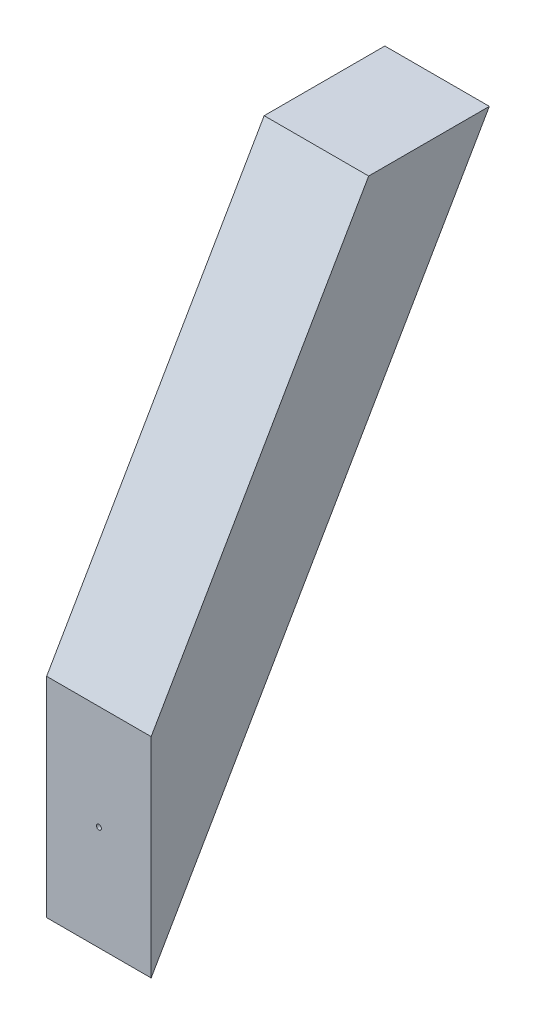
ISO-10303-21;
HEADER;
FILE_DESCRIPTION(('STEP AP214'),'2;1');
FILE_NAME('part.step','',(''),(''),'','','');
FILE_SCHEMA(('AUTOMOTIVE_DESIGN { 1 0 10303 214 1 1 1 1 }'));
ENDSEC;
DATA;
#1=APPLICATION_CONTEXT('core data for automotive mechanical design processes');
#2=APPLICATION_PROTOCOL_DEFINITION('international standard','automotive_design',2000,#1);
#3=PRODUCT_CONTEXT('',#1,'mechanical');
#4=PRODUCT('Part','Part','',(#3));
#5=PRODUCT_RELATED_PRODUCT_CATEGORY('part','',(#4));
#6=PRODUCT_DEFINITION_FORMATION('','',#4);
#7=PRODUCT_DEFINITION_CONTEXT('part definition',#1,'design');
#8=PRODUCT_DEFINITION('design','',#6,#7);
#9=PRODUCT_DEFINITION_SHAPE('','',#8);
#10=(LENGTH_UNIT() NAMED_UNIT(*) SI_UNIT(.MILLI.,.METRE.));
#11=(NAMED_UNIT(*) PLANE_ANGLE_UNIT() SI_UNIT($,.RADIAN.));
#12=(NAMED_UNIT(*) SI_UNIT($,.STERADIAN.) SOLID_ANGLE_UNIT());
#13=UNCERTAINTY_MEASURE_WITH_UNIT(LENGTH_MEASURE(1.E-05),#10,'distance_accuracy_value','');
#14=(GEOMETRIC_REPRESENTATION_CONTEXT(3) GLOBAL_UNCERTAINTY_ASSIGNED_CONTEXT((#13)) GLOBAL_UNIT_ASSIGNED_CONTEXT((#10,
#11,#12)) REPRESENTATION_CONTEXT('',''));
#15=CARTESIAN_POINT('',(0.,0.,0.));
#16=DIRECTION('',(0.,0.,1.));
#17=DIRECTION('',(1.,0.,0.));
#18=AXIS2_PLACEMENT_3D('',#15,#16,#17);
#19=CARTESIAN_POINT('',(12.7,142.357937738898,-82.1903936748331));
#20=DIRECTION('',(0.,0.500000000000001,0.866025403784438));
#21=DIRECTION('',(0.,-0.866025403784438,0.500000000000001));
#22=AXIS2_PLACEMENT_3D('',#19,#20,#21);
#23=PLANE('',#22);
#24=DIRECTION('',(0.,0.866025403784438,-0.500000000000001));
#25=VECTOR('',#24,1.);
#26=CARTESIAN_POINT('',(-12.7,142.357937738898,-82.1903936748331));
#27=LINE('',#26,#25);
#28=CARTESIAN_POINT('',(-12.7,0.,0.));
#29=VERTEX_POINT('',#28);
#30=CARTESIAN_POINT('',(-12.7,142.357937738898,-82.1903936748331));
#31=VERTEX_POINT('',#30);
#32=EDGE_CURVE('E95',#29,#31,#27,.T.);
#33=ORIENTED_EDGE('',*,*,#32,.T.);
#34=DIRECTION('',(-1.,0.,0.));
#35=VECTOR('',#34,1.);
#36=CARTESIAN_POINT('',(12.7,142.357937738898,-82.1903936748331));
#37=LINE('',#36,#35);
#38=CARTESIAN_POINT('',(12.7,142.357937738898,-82.1903936748331));
#39=VERTEX_POINT('',#38);
#40=EDGE_CURVE('E11',#39,#31,#37,.T.);
#41=ORIENTED_EDGE('',*,*,#40,.F.);
#42=DIRECTION('',(0.,0.866025403784438,-0.500000000000001));
#43=VECTOR('',#42,1.);
#44=CARTESIAN_POINT('',(12.7,142.357937738898,-82.1903936748331));
#45=LINE('',#44,#43);
#46=CARTESIAN_POINT('',(12.7,0.,0.));
#47=VERTEX_POINT('',#46);
#48=EDGE_CURVE('E104',#47,#39,#45,.T.);
#49=ORIENTED_EDGE('',*,*,#48,.F.);
#50=DIRECTION('',(-1.,0.,0.));
#51=VECTOR('',#50,1.);
#52=CARTESIAN_POINT('',(12.7,0.,0.));
#53=LINE('',#52,#51);
#54=EDGE_CURVE('E109',#47,#29,#53,.T.);
#55=ORIENTED_EDGE('',*,*,#54,.T.);
#56=EDGE_LOOP('',(#33,#41,#49,#55));
#57=FACE_BOUND('',#56,.T.);
#58=ADVANCED_FACE('F34',(#57),#23,.F.);
#59=CARTESIAN_POINT('',(12.7,142.357937738898,-52.8610000000001));
#60=DIRECTION('',(0.,-1.,0.));
#61=DIRECTION('',(0.,0.,-1.));
#62=AXIS2_PLACEMENT_3D('',#59,#60,#61);
#63=PLANE('',#62);
#64=DIRECTION('',(0.,0.,1.));
#65=VECTOR('',#64,1.);
#66=CARTESIAN_POINT('',(-12.7,142.357937738898,-52.8610000000001));
#67=LINE('',#66,#65);
#68=CARTESIAN_POINT('',(-12.7,142.357937738898,-52.8610000000001));
#69=VERTEX_POINT('',#68);
#70=EDGE_CURVE('E99',#31,#69,#67,.T.);
#71=ORIENTED_EDGE('',*,*,#70,.T.);
#72=DIRECTION('',(-1.,0.,0.));
#73=VECTOR('',#72,1.);
#74=CARTESIAN_POINT('',(12.7,142.357937738898,-52.8610000000001));
#75=LINE('',#74,#73);
#76=CARTESIAN_POINT('',(12.7,142.357937738898,-52.8610000000001));
#77=VERTEX_POINT('',#76);
#78=EDGE_CURVE('E42',#77,#69,#75,.T.);
#79=ORIENTED_EDGE('',*,*,#78,.F.);
#80=DIRECTION('',(0.,0.,1.));
#81=VECTOR('',#80,1.);
#82=CARTESIAN_POINT('',(12.7,142.357937738898,-52.8610000000001));
#83=LINE('',#82,#81);
#84=EDGE_CURVE('E81',#39,#77,#83,.T.);
#85=ORIENTED_EDGE('',*,*,#84,.F.);
#86=ORIENTED_EDGE('',*,*,#40,.T.);
#87=EDGE_LOOP('',(#71,#79,#85,#86));
#88=FACE_BOUND('',#87,.T.);
#89=ADVANCED_FACE('F133',(#88),#63,.F.);
#90=CARTESIAN_POINT('',(12.7,50.7999999999999,0.));
#91=DIRECTION('',(0.,-0.500000000000001,-0.866025403784438));
#92=DIRECTION('',(0.,0.866025403784438,-0.500000000000001));
#93=AXIS2_PLACEMENT_3D('',#90,#91,#92);
#94=PLANE('',#93);
#95=DIRECTION('',(0.,-0.866025403784438,0.500000000000001));
#96=VECTOR('',#95,1.);
#97=CARTESIAN_POINT('',(-12.7,50.7999999999999,0.));
#98=LINE('',#97,#96);
#99=CARTESIAN_POINT('',(-12.7,50.7999999999999,0.));
#100=VERTEX_POINT('',#99);
#101=EDGE_CURVE('E68',#69,#100,#98,.T.);
#102=ORIENTED_EDGE('',*,*,#101,.T.);
#103=DIRECTION('',(-1.,0.,0.));
#104=VECTOR('',#103,1.);
#105=CARTESIAN_POINT('',(12.7,50.7999999999999,0.));
#106=LINE('',#105,#104);
#107=CARTESIAN_POINT('',(12.7,50.7999999999999,0.));
#108=VERTEX_POINT('',#107);
#109=EDGE_CURVE('E115',#108,#100,#106,.T.);
#110=ORIENTED_EDGE('',*,*,#109,.F.);
#111=DIRECTION('',(0.,-0.866025403784438,0.500000000000001));
#112=VECTOR('',#111,1.);
#113=CARTESIAN_POINT('',(12.7,50.7999999999999,0.));
#114=LINE('',#113,#112);
#115=EDGE_CURVE('E107',#77,#108,#114,.T.);
#116=ORIENTED_EDGE('',*,*,#115,.F.);
#117=ORIENTED_EDGE('',*,*,#78,.T.);
#118=EDGE_LOOP('',(#102,#110,#116,#117));
#119=FACE_BOUND('',#118,.T.);
#120=ADVANCED_FACE('F117',(#119),#94,.F.);
#121=CARTESIAN_POINT('',(12.7,0.,0.));
#122=DIRECTION('',(0.,0.,-1.));
#123=DIRECTION('',(-1.,0.,0.));
#124=AXIS2_PLACEMENT_3D('',#121,#122,#123);
#125=PLANE('',#124);
#126=CARTESIAN_POINT('',(0.,25.3999999999999,0.));
#127=DIRECTION('',(0.,0.,1.));
#128=DIRECTION('',(1.,0.,0.));
#129=AXIS2_PLACEMENT_3D('',#126,#127,#128);
#130=CIRCLE('',#129,0.595629999999997);
#131=CARTESIAN_POINT('',(0.595629999999997,25.3999999999999,0.));
#132=VERTEX_POINT('',#131);
#133=EDGE_CURVE('E96',#132,#132,#130,.T.);
#134=ORIENTED_EDGE('',*,*,#133,.F.);
#135=EDGE_LOOP('',(#134));
#136=FACE_BOUND('',#135,.T.);
#137=DIRECTION('',(0.,-1.,0.));
#138=VECTOR('',#137,1.);
#139=CARTESIAN_POINT('',(-12.7,0.,0.));
#140=LINE('',#139,#138);
#141=EDGE_CURVE('E74',#100,#29,#140,.T.);
#142=ORIENTED_EDGE('',*,*,#141,.T.);
#143=ORIENTED_EDGE('',*,*,#54,.F.);
#144=DIRECTION('',(0.,-1.,0.));
#145=VECTOR('',#144,1.);
#146=CARTESIAN_POINT('',(12.7,0.,0.));
#147=LINE('',#146,#145);
#148=EDGE_CURVE('E50',#108,#47,#147,.T.);
#149=ORIENTED_EDGE('',*,*,#148,.F.);
#150=ORIENTED_EDGE('',*,*,#109,.T.);
#151=EDGE_LOOP('',(#142,#143,#149,#150));
#152=FACE_BOUND('',#151,.T.);
#153=ADVANCED_FACE('F123',(#136,#152),#125,.F.);
#154=CARTESIAN_POINT('',(12.7,0.,0.));
#155=DIRECTION('',(1.,0.,0.));
#156=DIRECTION('',(0.,0.,-1.));
#157=AXIS2_PLACEMENT_3D('',#154,#155,#156);
#158=PLANE('',#157);
#159=ORIENTED_EDGE('',*,*,#48,.T.);
#160=ORIENTED_EDGE('',*,*,#84,.T.);
#161=ORIENTED_EDGE('',*,*,#115,.T.);
#162=ORIENTED_EDGE('',*,*,#148,.T.);
#163=EDGE_LOOP('',(#159,#160,#161,#162));
#164=FACE_BOUND('',#163,.T.);
#165=ADVANCED_FACE('F125',(#164),#158,.T.);
#166=CARTESIAN_POINT('',(-12.7,0.,0.));
#167=DIRECTION('',(1.,0.,0.));
#168=DIRECTION('',(0.,0.,-1.));
#169=AXIS2_PLACEMENT_3D('',#166,#167,#168);
#170=PLANE('',#169);
#171=ORIENTED_EDGE('',*,*,#32,.F.);
#172=ORIENTED_EDGE('',*,*,#141,.F.);
#173=ORIENTED_EDGE('',*,*,#101,.F.);
#174=ORIENTED_EDGE('',*,*,#70,.F.);
#175=EDGE_LOOP('',(#171,#172,#173,#174));
#176=FACE_BOUND('',#175,.T.);
#177=ADVANCED_FACE('F89',(#176),#170,.F.);
#178=CARTESIAN_POINT('',(0.,25.3999999999999,-10.));
#179=DIRECTION('',(0.,0.,1.));
#180=DIRECTION('',(1.,0.,0.));
#181=AXIS2_PLACEMENT_3D('',#178,#179,#180);
#182=CONICAL_SURFACE('',#181,0.595629999999996,1.02974425867665);
#183=CARTESIAN_POINT('',(0.,25.3999999999999,-10.3578906105114));
#184=VERTEX_POINT('',#183);
#185=VERTEX_LOOP('',#184);
#186=FACE_BOUND('',#185,.T.);
#187=CARTESIAN_POINT('',(0.,25.3999999999999,-10.));
#188=DIRECTION('',(0.,0.,1.));
#189=DIRECTION('',(1.,0.,0.));
#190=AXIS2_PLACEMENT_3D('',#187,#188,#189);
#191=CIRCLE('',#190,0.595629999999996);
#192=CARTESIAN_POINT('',(0.595629999999996,25.3999999999999,-10.));
#193=VERTEX_POINT('',#192);
#194=EDGE_CURVE('E93',#193,#193,#191,.T.);
#195=ORIENTED_EDGE('',*,*,#194,.T.);
#196=EDGE_LOOP('',(#195));
#197=FACE_BOUND('',#196,.T.);
#198=ADVANCED_FACE('F85',(#186,#197),#182,.F.);
#199=CARTESIAN_POINT('',(0.,25.3999999999999,0.));
#200=DIRECTION('',(0.,0.,1.));
#201=DIRECTION('',(1.,0.,0.));
#202=AXIS2_PLACEMENT_3D('',#199,#200,#201);
#203=CYLINDRICAL_SURFACE('',#202,0.595629999999997);
#204=ORIENTED_EDGE('',*,*,#194,.F.);
#205=EDGE_LOOP('',(#204));
#206=FACE_BOUND('',#205,.T.);
#207=ORIENTED_EDGE('',*,*,#133,.T.);
#208=EDGE_LOOP('',(#207));
#209=FACE_BOUND('',#208,.T.);
#210=ADVANCED_FACE('F88',(#206,#209),#203,.F.);
#211=CLOSED_SHELL('',(#58,#89,#120,#153,#165,#177,#198,#210));
#212=MANIFOLD_SOLID_BREP('B2',#211);
#213=ADVANCED_BREP_SHAPE_REPRESENTATION('',(#18,#212),#14);
#214=SHAPE_DEFINITION_REPRESENTATION(#9,#213);
ENDSEC;
END-ISO-10303-21;
